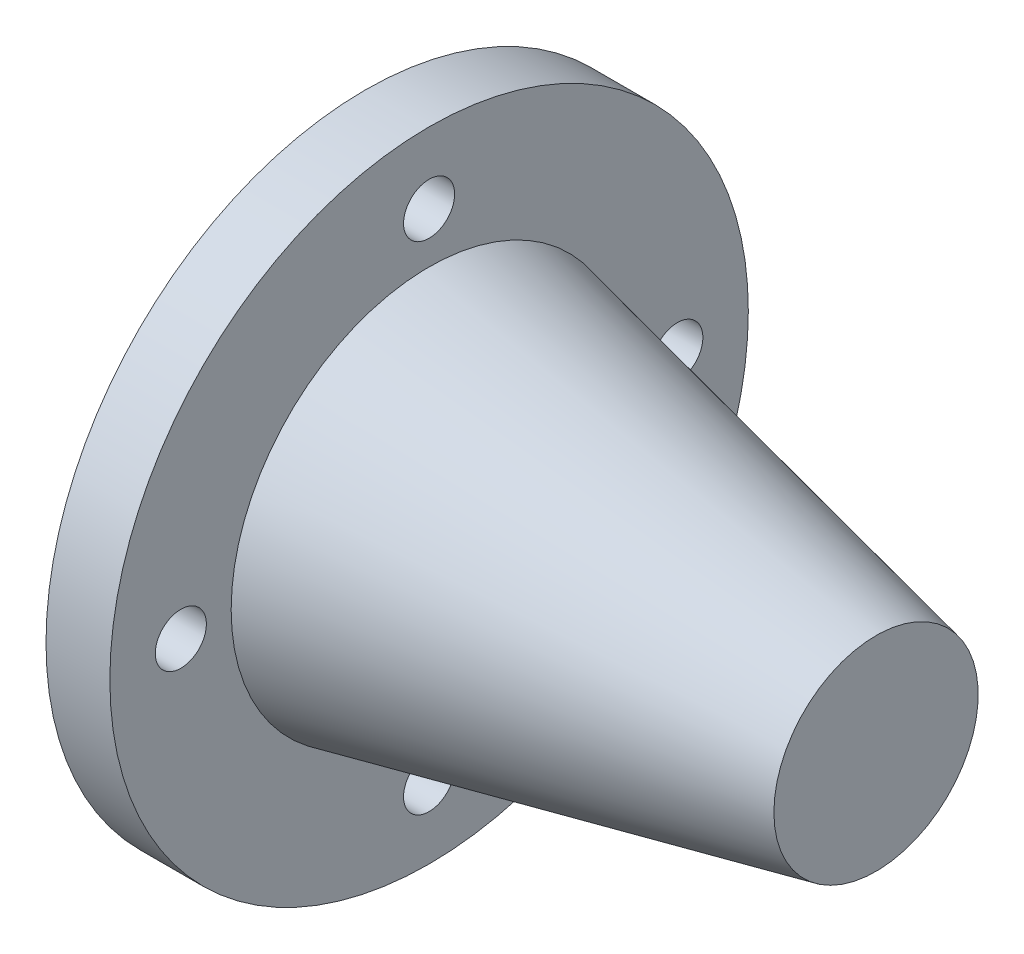
ISO-10303-21;
HEADER;
FILE_DESCRIPTION(('STEP AP214'),'2;1');
FILE_NAME('part.step','',(''),(''),'','','');
FILE_SCHEMA(('AUTOMOTIVE_DESIGN { 1 0 10303 214 1 1 1 1 }'));
ENDSEC;
DATA;
#1=APPLICATION_CONTEXT('core data for automotive mechanical design processes');
#2=APPLICATION_PROTOCOL_DEFINITION('international standard','automotive_design',2000,#1);
#3=PRODUCT_CONTEXT('',#1,'mechanical');
#4=PRODUCT('Part','Part','',(#3));
#5=PRODUCT_RELATED_PRODUCT_CATEGORY('part','',(#4));
#6=PRODUCT_DEFINITION_FORMATION('','',#4);
#7=PRODUCT_DEFINITION_CONTEXT('part definition',#1,'design');
#8=PRODUCT_DEFINITION('design','',#6,#7);
#9=PRODUCT_DEFINITION_SHAPE('','',#8);
#10=(LENGTH_UNIT() NAMED_UNIT(*) SI_UNIT(.MILLI.,.METRE.));
#11=(NAMED_UNIT(*) PLANE_ANGLE_UNIT() SI_UNIT($,.RADIAN.));
#12=(NAMED_UNIT(*) SI_UNIT($,.STERADIAN.) SOLID_ANGLE_UNIT());
#13=UNCERTAINTY_MEASURE_WITH_UNIT(LENGTH_MEASURE(1.E-05),#10,'distance_accuracy_value','');
#14=(GEOMETRIC_REPRESENTATION_CONTEXT(3) GLOBAL_UNCERTAINTY_ASSIGNED_CONTEXT((#13)) GLOBAL_UNIT_ASSIGNED_CONTEXT((#10,
#11,#12)) REPRESENTATION_CONTEXT('',''));
#15=CARTESIAN_POINT('',(0.,0.,0.));
#16=DIRECTION('',(0.,0.,1.));
#17=DIRECTION('',(1.,0.,0.));
#18=AXIS2_PLACEMENT_3D('',#15,#16,#17);
#19=CARTESIAN_POINT('',(0.,25.,0.));
#20=DIRECTION('',(1.,0.,0.));
#21=DIRECTION('',(0.,0.,-1.));
#22=AXIS2_PLACEMENT_3D('',#19,#20,#21);
#23=PLANE('',#22);
#24=CARTESIAN_POINT('',(0.,19.44,-2.03623191681332E-13));
#25=DIRECTION('',(-1.,0.,0.));
#26=DIRECTION('',(0.,0.,1.));
#27=AXIS2_PLACEMENT_3D('',#24,#25,#26);
#28=CIRCLE('',#27,1.99999999999999);
#29=CARTESIAN_POINT('',(0.,19.44,1.99999999999978));
#30=VERTEX_POINT('',#29);
#31=EDGE_CURVE('E219',#30,#30,#28,.T.);
#32=ORIENTED_EDGE('',*,*,#31,.F.);
#33=EDGE_LOOP('',(#32));
#34=FACE_BOUND('',#33,.T.);
#35=CARTESIAN_POINT('',(0.,0.,19.44));
#36=DIRECTION('',(-1.,0.,0.));
#37=DIRECTION('',(0.,0.,1.));
#38=AXIS2_PLACEMENT_3D('',#35,#36,#37);
#39=CIRCLE('',#38,1.99999999999999);
#40=CARTESIAN_POINT('',(0.,0.,21.44));
#41=VERTEX_POINT('',#40);
#42=EDGE_CURVE('E88',#41,#41,#39,.T.);
#43=ORIENTED_EDGE('',*,*,#42,.F.);
#44=EDGE_LOOP('',(#43));
#45=FACE_BOUND('',#44,.T.);
#46=CARTESIAN_POINT('',(0.,0.,-19.44));
#47=DIRECTION('',(-1.,0.,0.));
#48=DIRECTION('',(0.,0.,1.));
#49=AXIS2_PLACEMENT_3D('',#46,#47,#48);
#50=CIRCLE('',#49,1.99999999999999);
#51=CARTESIAN_POINT('',(0.,0.,-17.44));
#52=VERTEX_POINT('',#51);
#53=EDGE_CURVE('E85',#52,#52,#50,.T.);
#54=ORIENTED_EDGE('',*,*,#53,.F.);
#55=EDGE_LOOP('',(#54));
#56=FACE_BOUND('',#55,.T.);
#57=CARTESIAN_POINT('',(0.,0.,0.));
#58=DIRECTION('',(-1.,0.,0.));
#59=DIRECTION('',(0.,0.,1.));
#60=AXIS2_PLACEMENT_3D('',#57,#58,#59);
#61=CIRCLE('',#60,12.75);
#62=CARTESIAN_POINT('',(0.,0.,12.75));
#63=VERTEX_POINT('',#62);
#64=EDGE_CURVE('E11',#63,#63,#61,.T.);
#65=ORIENTED_EDGE('',*,*,#64,.F.);
#66=EDGE_LOOP('',(#65));
#67=FACE_BOUND('',#66,.T.);
#68=CARTESIAN_POINT('',(0.,0.,0.));
#69=DIRECTION('',(-1.,0.,0.));
#70=DIRECTION('',(0.,0.,1.));
#71=AXIS2_PLACEMENT_3D('',#68,#69,#70);
#72=CIRCLE('',#71,25.);
#73=CARTESIAN_POINT('',(0.,0.,25.));
#74=VERTEX_POINT('',#73);
#75=EDGE_CURVE('E76',#74,#74,#72,.T.);
#76=ORIENTED_EDGE('',*,*,#75,.T.);
#77=EDGE_LOOP('',(#76));
#78=FACE_BOUND('',#77,.T.);
#79=CARTESIAN_POINT('',(0.,-19.44,0.));
#80=DIRECTION('',(-1.,0.,0.));
#81=DIRECTION('',(0.,0.,1.));
#82=AXIS2_PLACEMENT_3D('',#79,#80,#81);
#83=CIRCLE('',#82,1.99999999999999);
#84=CARTESIAN_POINT('',(0.,-19.44,2.00000000000006));
#85=VERTEX_POINT('',#84);
#86=EDGE_CURVE('E79',#85,#85,#83,.T.);
#87=ORIENTED_EDGE('',*,*,#86,.F.);
#88=EDGE_LOOP('',(#87));
#89=FACE_BOUND('',#88,.T.);
#90=ADVANCED_FACE('F32',(#34,#45,#56,#67,#78,#89),#23,.F.);
#91=CARTESIAN_POINT('',(-34.8424888057082,0.,0.));
#92=DIRECTION('',(-1.,0.,0.));
#93=DIRECTION('',(0.,0.,1.));
#94=AXIS2_PLACEMENT_3D('',#91,#92,#93);
#95=CYLINDRICAL_SURFACE('',#94,12.75);
#96=CARTESIAN_POINT('',(3.,0.,0.));
#97=DIRECTION('',(-1.,0.,0.));
#98=DIRECTION('',(0.,0.,1.));
#99=AXIS2_PLACEMENT_3D('',#96,#97,#98);
#100=CIRCLE('',#99,12.75);
#101=CARTESIAN_POINT('',(3.,0.,12.75));
#102=VERTEX_POINT('',#101);
#103=EDGE_CURVE('E38',#102,#102,#100,.T.);
#104=ORIENTED_EDGE('',*,*,#103,.F.);
#105=EDGE_LOOP('',(#104));
#106=FACE_BOUND('',#105,.T.);
#107=ORIENTED_EDGE('',*,*,#64,.T.);
#108=EDGE_LOOP('',(#107));
#109=FACE_BOUND('',#108,.T.);
#110=ADVANCED_FACE('F65',(#106,#109),#95,.F.);
#111=CARTESIAN_POINT('',(3.,12.75,0.));
#112=DIRECTION('',(1.,0.,0.));
#113=DIRECTION('',(0.,0.,-1.));
#114=AXIS2_PLACEMENT_3D('',#111,#112,#113);
#115=PLANE('',#114);
#116=CARTESIAN_POINT('',(3.,0.,0.));
#117=DIRECTION('',(-1.,0.,0.));
#118=DIRECTION('',(0.,0.,1.));
#119=AXIS2_PLACEMENT_3D('',#116,#117,#118);
#120=CIRCLE('',#119,9.75);
#121=CARTESIAN_POINT('',(3.,0.,9.75));
#122=VERTEX_POINT('',#121);
#123=EDGE_CURVE('E51',#122,#122,#120,.T.);
#124=ORIENTED_EDGE('',*,*,#123,.F.);
#125=EDGE_LOOP('',(#124));
#126=FACE_BOUND('',#125,.T.);
#127=ORIENTED_EDGE('',*,*,#103,.T.);
#128=EDGE_LOOP('',(#127));
#129=FACE_BOUND('',#128,.T.);
#130=ADVANCED_FACE('F63',(#126,#129),#115,.F.);
#131=CARTESIAN_POINT('',(3.,0.,0.));
#132=DIRECTION('',(-1.,0.,0.));
#133=DIRECTION('',(0.,0.,1.));
#134=AXIS2_PLACEMENT_3D('',#131,#132,#133);
#135=CONICAL_SURFACE('',#134,9.75,0.112028962425988);
#136=CARTESIAN_POINT('',(23.,0.,0.));
#137=DIRECTION('',(-1.,0.,0.));
#138=DIRECTION('',(0.,0.,1.));
#139=AXIS2_PLACEMENT_3D('',#136,#137,#138);
#140=CIRCLE('',#139,7.5);
#141=CARTESIAN_POINT('',(23.,0.,7.5));
#142=VERTEX_POINT('',#141);
#143=EDGE_CURVE('E49',#142,#142,#140,.T.);
#144=ORIENTED_EDGE('',*,*,#143,.F.);
#145=EDGE_LOOP('',(#144));
#146=FACE_BOUND('',#145,.T.);
#147=ORIENTED_EDGE('',*,*,#123,.T.);
#148=EDGE_LOOP('',(#147));
#149=FACE_BOUND('',#148,.T.);
#150=ADVANCED_FACE('F45',(#146,#149),#135,.F.);
#151=CARTESIAN_POINT('',(23.,0.,0.));
#152=DIRECTION('',(-1.,0.,0.));
#153=DIRECTION('',(0.,0.,1.));
#154=AXIS2_PLACEMENT_3D('',#151,#152,#153);
#155=CONICAL_SURFACE('',#154,7.5,0.463647609000806);
#156=CARTESIAN_POINT('',(38.,0.,0.));
#157=VERTEX_POINT('',#156);
#158=VERTEX_LOOP('',#157);
#159=FACE_BOUND('',#158,.T.);
#160=ORIENTED_EDGE('',*,*,#143,.T.);
#161=EDGE_LOOP('',(#160));
#162=FACE_BOUND('',#161,.T.);
#163=ADVANCED_FACE('F41',(#159,#162),#155,.F.);
#164=CARTESIAN_POINT('',(40.,0.,0.));
#165=DIRECTION('',(-1.,0.,0.));
#166=DIRECTION('',(0.,0.,1.));
#167=AXIS2_PLACEMENT_3D('',#164,#165,#166);
#168=PLANE('',#167);
#169=CARTESIAN_POINT('',(40.,0.,0.));
#170=DIRECTION('',(-1.,0.,0.));
#171=DIRECTION('',(0.,0.,1.));
#172=AXIS2_PLACEMENT_3D('',#169,#170,#171);
#173=CIRCLE('',#172,8.);
#174=CARTESIAN_POINT('',(40.,0.,8.));
#175=VERTEX_POINT('',#174);
#176=EDGE_CURVE('E52',#175,#175,#173,.T.);
#177=ORIENTED_EDGE('',*,*,#176,.F.);
#178=EDGE_LOOP('',(#177));
#179=FACE_BOUND('',#178,.T.);
#180=ADVANCED_FACE('F44',(#179),#168,.F.);
#181=CARTESIAN_POINT('',(40.,0.,0.));
#182=DIRECTION('',(-1.,0.,0.));
#183=DIRECTION('',(0.,0.,1.));
#184=AXIS2_PLACEMENT_3D('',#181,#182,#183);
#185=CONICAL_SURFACE('',#184,8.,0.211093333222747);
#186=CARTESIAN_POINT('',(5.,0.,0.));
#187=DIRECTION('',(-1.,0.,0.));
#188=DIRECTION('',(0.,0.,1.));
#189=AXIS2_PLACEMENT_3D('',#186,#187,#188);
#190=CIRCLE('',#189,15.5);
#191=CARTESIAN_POINT('',(5.,0.,15.5));
#192=VERTEX_POINT('',#191);
#193=EDGE_CURVE('E57',#192,#192,#190,.T.);
#194=ORIENTED_EDGE('',*,*,#193,.F.);
#195=EDGE_LOOP('',(#194));
#196=FACE_BOUND('',#195,.T.);
#197=ORIENTED_EDGE('',*,*,#176,.T.);
#198=EDGE_LOOP('',(#197));
#199=FACE_BOUND('',#198,.T.);
#200=ADVANCED_FACE('F105',(#196,#199),#185,.T.);
#201=CARTESIAN_POINT('',(5.,15.5,0.));
#202=DIRECTION('',(-1.,0.,0.));
#203=DIRECTION('',(0.,0.,1.));
#204=AXIS2_PLACEMENT_3D('',#201,#202,#203);
#205=PLANE('',#204);
#206=CARTESIAN_POINT('',(5.,19.44,-2.03623191681332E-13));
#207=DIRECTION('',(-1.,0.,0.));
#208=DIRECTION('',(0.,0.,1.));
#209=AXIS2_PLACEMENT_3D('',#206,#207,#208);
#210=CIRCLE('',#209,1.99999999999999);
#211=CARTESIAN_POINT('',(5.,19.44,1.99999999999979));
#212=VERTEX_POINT('',#211);
#213=EDGE_CURVE('E216',#212,#212,#210,.T.);
#214=ORIENTED_EDGE('',*,*,#213,.T.);
#215=EDGE_LOOP('',(#214));
#216=FACE_BOUND('',#215,.T.);
#217=CARTESIAN_POINT('',(5.,0.,19.44));
#218=DIRECTION('',(-1.,0.,0.));
#219=DIRECTION('',(0.,0.,1.));
#220=AXIS2_PLACEMENT_3D('',#217,#218,#219);
#221=CIRCLE('',#220,1.99999999999999);
#222=CARTESIAN_POINT('',(5.,0.,21.44));
#223=VERTEX_POINT('',#222);
#224=EDGE_CURVE('E82',#223,#223,#221,.T.);
#225=ORIENTED_EDGE('',*,*,#224,.T.);
#226=EDGE_LOOP('',(#225));
#227=FACE_BOUND('',#226,.T.);
#228=CARTESIAN_POINT('',(5.,-19.44,0.));
#229=DIRECTION('',(-1.,0.,0.));
#230=DIRECTION('',(0.,0.,1.));
#231=AXIS2_PLACEMENT_3D('',#228,#229,#230);
#232=CIRCLE('',#231,1.99999999999999);
#233=CARTESIAN_POINT('',(5.,-19.44,2.00000000000006));
#234=VERTEX_POINT('',#233);
#235=EDGE_CURVE('E81',#234,#234,#232,.T.);
#236=ORIENTED_EDGE('',*,*,#235,.T.);
#237=EDGE_LOOP('',(#236));
#238=FACE_BOUND('',#237,.T.);
#239=CARTESIAN_POINT('',(5.,0.,-19.44));
#240=DIRECTION('',(-1.,0.,0.));
#241=DIRECTION('',(0.,0.,1.));
#242=AXIS2_PLACEMENT_3D('',#239,#240,#241);
#243=CIRCLE('',#242,1.99999999999999);
#244=CARTESIAN_POINT('',(5.,0.,-17.44));
#245=VERTEX_POINT('',#244);
#246=EDGE_CURVE('E94',#245,#245,#243,.T.);
#247=ORIENTED_EDGE('',*,*,#246,.T.);
#248=EDGE_LOOP('',(#247));
#249=FACE_BOUND('',#248,.T.);
#250=CARTESIAN_POINT('',(5.,0.,0.));
#251=DIRECTION('',(-1.,0.,0.));
#252=DIRECTION('',(0.,0.,1.));
#253=AXIS2_PLACEMENT_3D('',#250,#251,#252);
#254=CIRCLE('',#253,25.);
#255=CARTESIAN_POINT('',(5.,0.,25.));
#256=VERTEX_POINT('',#255);
#257=EDGE_CURVE('E98',#256,#256,#254,.T.);
#258=ORIENTED_EDGE('',*,*,#257,.F.);
#259=EDGE_LOOP('',(#258));
#260=FACE_BOUND('',#259,.T.);
#261=ORIENTED_EDGE('',*,*,#193,.T.);
#262=EDGE_LOOP('',(#261));
#263=FACE_BOUND('',#262,.T.);
#264=ADVANCED_FACE('F103',(#216,#227,#238,#249,#260,#263),#205,.F.);
#265=CARTESIAN_POINT('',(-34.8424888057082,0.,0.));
#266=DIRECTION('',(-1.,0.,0.));
#267=DIRECTION('',(0.,0.,1.));
#268=AXIS2_PLACEMENT_3D('',#265,#266,#267);
#269=CYLINDRICAL_SURFACE('',#268,25.);
#270=ORIENTED_EDGE('',*,*,#75,.F.);
#271=EDGE_LOOP('',(#270));
#272=FACE_BOUND('',#271,.T.);
#273=ORIENTED_EDGE('',*,*,#257,.T.);
#274=EDGE_LOOP('',(#273));
#275=FACE_BOUND('',#274,.T.);
#276=ADVANCED_FACE('F152',(#272,#275),#269,.T.);
#277=CARTESIAN_POINT('',(0.,0.,-19.44));
#278=DIRECTION('',(-1.,0.,0.));
#279=DIRECTION('',(0.,0.,1.));
#280=AXIS2_PLACEMENT_3D('',#277,#278,#279);
#281=CYLINDRICAL_SURFACE('',#280,1.99999999999999);
#282=ORIENTED_EDGE('',*,*,#246,.F.);
#283=EDGE_LOOP('',(#282));
#284=FACE_BOUND('',#283,.T.);
#285=ORIENTED_EDGE('',*,*,#53,.T.);
#286=EDGE_LOOP('',(#285));
#287=FACE_BOUND('',#286,.T.);
#288=ADVANCED_FACE('F157',(#284,#287),#281,.F.);
#289=CARTESIAN_POINT('',(0.,-19.44,0.));
#290=DIRECTION('',(-1.,0.,0.));
#291=DIRECTION('',(0.,0.,1.));
#292=AXIS2_PLACEMENT_3D('',#289,#290,#291);
#293=CYLINDRICAL_SURFACE('',#292,1.99999999999999);
#294=ORIENTED_EDGE('',*,*,#235,.F.);
#295=EDGE_LOOP('',(#294));
#296=FACE_BOUND('',#295,.T.);
#297=ORIENTED_EDGE('',*,*,#86,.T.);
#298=EDGE_LOOP('',(#297));
#299=FACE_BOUND('',#298,.T.);
#300=ADVANCED_FACE('F167',(#296,#299),#293,.F.);
#301=CARTESIAN_POINT('',(0.,0.,19.44));
#302=DIRECTION('',(-1.,0.,0.));
#303=DIRECTION('',(0.,0.,1.));
#304=AXIS2_PLACEMENT_3D('',#301,#302,#303);
#305=CYLINDRICAL_SURFACE('',#304,1.99999999999999);
#306=ORIENTED_EDGE('',*,*,#224,.F.);
#307=EDGE_LOOP('',(#306));
#308=FACE_BOUND('',#307,.T.);
#309=ORIENTED_EDGE('',*,*,#42,.T.);
#310=EDGE_LOOP('',(#309));
#311=FACE_BOUND('',#310,.T.);
#312=ADVANCED_FACE('F189',(#308,#311),#305,.F.);
#313=CARTESIAN_POINT('',(0.,19.44,-2.03623191681332E-13));
#314=DIRECTION('',(-1.,0.,0.));
#315=DIRECTION('',(0.,0.,1.));
#316=AXIS2_PLACEMENT_3D('',#313,#314,#315);
#317=CYLINDRICAL_SURFACE('',#316,1.99999999999999);
#318=ORIENTED_EDGE('',*,*,#213,.F.);
#319=EDGE_LOOP('',(#318));
#320=FACE_BOUND('',#319,.T.);
#321=ORIENTED_EDGE('',*,*,#31,.T.);
#322=EDGE_LOOP('',(#321));
#323=FACE_BOUND('',#322,.T.);
#324=ADVANCED_FACE('F199',(#320,#323),#317,.F.);
#325=CLOSED_SHELL('',(#90,#110,#130,#150,#163,#180,#200,#264,#276,#288,#300,#312,#324));
#326=MANIFOLD_SOLID_BREP('B2',#325);
#327=ADVANCED_BREP_SHAPE_REPRESENTATION('',(#18,#326),#14);
#328=SHAPE_DEFINITION_REPRESENTATION(#9,#327);
ENDSEC;
END-ISO-10303-21;
